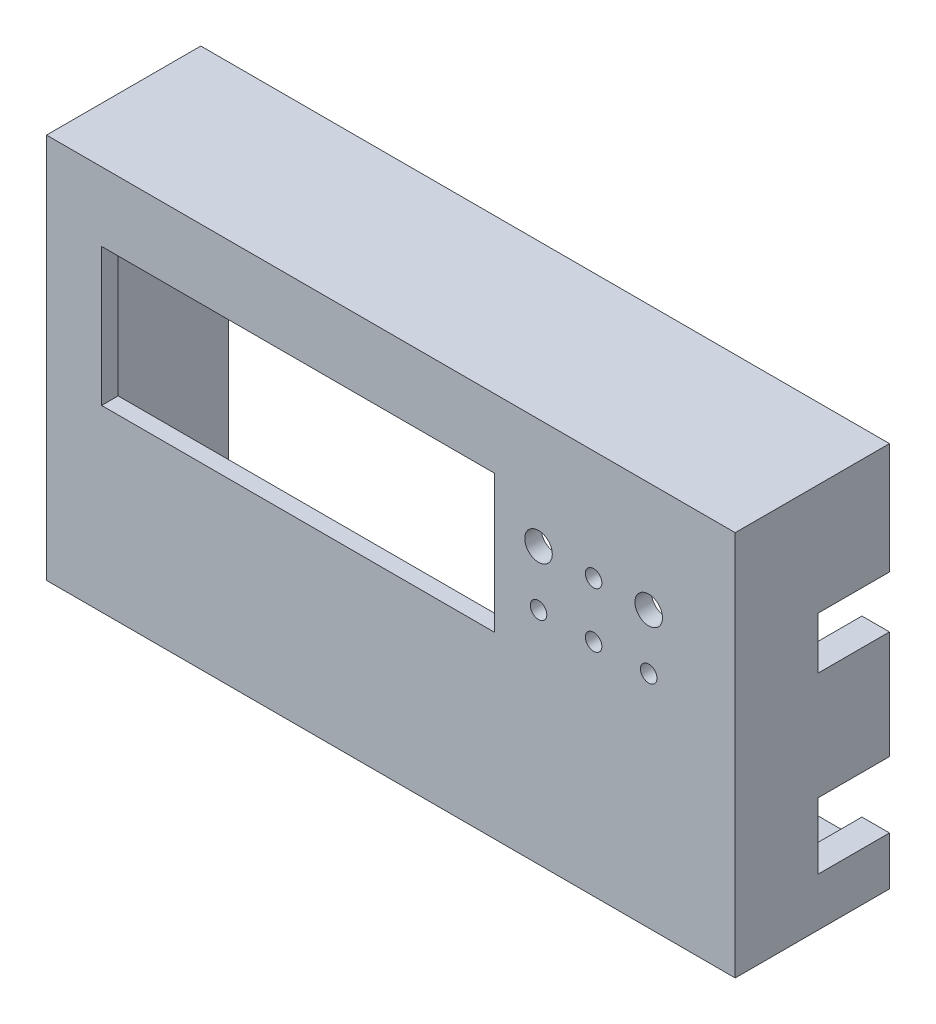
ISO-10303-21;
HEADER;
FILE_DESCRIPTION(('STEP AP214'),'2;1');
FILE_NAME('part.step','',(''),(''),'','','');
FILE_SCHEMA(('AUTOMOTIVE_DESIGN { 1 0 10303 214 1 1 1 1 }'));
ENDSEC;
DATA;
#1=APPLICATION_CONTEXT('core data for automotive mechanical design processes');
#2=APPLICATION_PROTOCOL_DEFINITION('international standard','automotive_design',2000,#1);
#3=PRODUCT_CONTEXT('',#1,'mechanical');
#4=PRODUCT('Part','Part','',(#3));
#5=PRODUCT_RELATED_PRODUCT_CATEGORY('part','',(#4));
#6=PRODUCT_DEFINITION_FORMATION('','',#4);
#7=PRODUCT_DEFINITION_CONTEXT('part definition',#1,'design');
#8=PRODUCT_DEFINITION('design','',#6,#7);
#9=PRODUCT_DEFINITION_SHAPE('','',#8);
#10=(LENGTH_UNIT() NAMED_UNIT(*) SI_UNIT(.MILLI.,.METRE.));
#11=(NAMED_UNIT(*) PLANE_ANGLE_UNIT() SI_UNIT($,.RADIAN.));
#12=(NAMED_UNIT(*) SI_UNIT($,.STERADIAN.) SOLID_ANGLE_UNIT());
#13=UNCERTAINTY_MEASURE_WITH_UNIT(LENGTH_MEASURE(1.E-05),#10,'distance_accuracy_value','');
#14=(GEOMETRIC_REPRESENTATION_CONTEXT(3) GLOBAL_UNCERTAINTY_ASSIGNED_CONTEXT((#13)) GLOBAL_UNIT_ASSIGNED_CONTEXT((#10,
#11,#12)) REPRESENTATION_CONTEXT('',''));
#15=CARTESIAN_POINT('',(0.,0.,0.));
#16=DIRECTION('',(0.,0.,1.));
#17=DIRECTION('',(1.,0.,0.));
#18=AXIS2_PLACEMENT_3D('',#15,#16,#17);
#19=CARTESIAN_POINT('',(0.,0.,-25.));
#20=DIRECTION('',(0.,0.,-1.));
#21=DIRECTION('',(-1.,0.,0.));
#22=AXIS2_PLACEMENT_3D('',#19,#20,#21);
#23=PLANE('',#22);
#24=DIRECTION('',(1.,0.,0.));
#25=VECTOR('',#24,1.);
#26=CARTESIAN_POINT('',(115.,8.8,-25.));
#27=LINE('',#26,#25);
#28=CARTESIAN_POINT('',(120.,8.8,-25.));
#29=VERTEX_POINT('',#28);
#30=CARTESIAN_POINT('',(125.,8.8,-25.));
#31=VERTEX_POINT('',#30);
#32=EDGE_CURVE('E379',#29,#31,#27,.T.);
#33=ORIENTED_EDGE('',*,*,#32,.T.);
#34=DIRECTION('',(0.,1.,0.));
#35=VECTOR('',#34,1.);
#36=CARTESIAN_POINT('',(125.,0.,-25.));
#37=LINE('',#36,#35);
#38=CARTESIAN_POINT('',(125.,0.,-25.));
#39=VERTEX_POINT('',#38);
#40=EDGE_CURVE('E227',#39,#31,#37,.T.);
#41=ORIENTED_EDGE('',*,*,#40,.F.);
#42=DIRECTION('',(1.,0.,0.));
#43=VECTOR('',#42,1.);
#44=CARTESIAN_POINT('',(0.,0.,-25.));
#45=LINE('',#44,#43);
#46=CARTESIAN_POINT('',(0.,0.,-25.));
#47=VERTEX_POINT('',#46);
#48=EDGE_CURVE('E232',#47,#39,#45,.T.);
#49=ORIENTED_EDGE('',*,*,#48,.F.);
#50=DIRECTION('',(0.,1.,0.));
#51=VECTOR('',#50,1.);
#52=CARTESIAN_POINT('',(0.,0.,-25.));
#53=LINE('',#52,#51);
#54=CARTESIAN_POINT('',(0.,70.,-25.));
#55=VERTEX_POINT('',#54);
#56=EDGE_CURVE('E484',#47,#55,#53,.T.);
#57=ORIENTED_EDGE('',*,*,#56,.T.);
#58=DIRECTION('',(1.,0.,0.));
#59=VECTOR('',#58,1.);
#60=CARTESIAN_POINT('',(0.,70.,-25.));
#61=LINE('',#60,#59);
#62=CARTESIAN_POINT('',(125.,70.,-25.));
#63=VERTEX_POINT('',#62);
#64=EDGE_CURVE('E233',#55,#63,#61,.T.);
#65=ORIENTED_EDGE('',*,*,#64,.T.);
#66=CARTESIAN_POINT('',(125.,49.8225738807836,-25.));
#67=VERTEX_POINT('',#66);
#68=EDGE_CURVE('E228',#67,#63,#37,.T.);
#69=ORIENTED_EDGE('',*,*,#68,.F.);
#70=DIRECTION('',(1.,0.,0.));
#71=VECTOR('',#70,1.);
#72=CARTESIAN_POINT('',(115.,49.8225738807836,-25.));
#73=LINE('',#72,#71);
#74=CARTESIAN_POINT('',(120.,49.8225738807836,-25.));
#75=VERTEX_POINT('',#74);
#76=EDGE_CURVE('E399',#75,#67,#73,.T.);
#77=ORIENTED_EDGE('',*,*,#76,.F.);
#78=DIRECTION('',(0.,1.,0.));
#79=VECTOR('',#78,1.);
#80=CARTESIAN_POINT('',(120.,4.99999999999999,-25.));
#81=LINE('',#80,#79);
#82=CARTESIAN_POINT('',(120.,65.,-25.));
#83=VERTEX_POINT('',#82);
#84=EDGE_CURVE('E449',#75,#83,#81,.T.);
#85=ORIENTED_EDGE('',*,*,#84,.T.);
#86=DIRECTION('',(1.,0.,0.));
#87=VECTOR('',#86,1.);
#88=CARTESIAN_POINT('',(5.,65.,-25.));
#89=LINE('',#88,#87);
#90=CARTESIAN_POINT('',(5.,65.,-25.));
#91=VERTEX_POINT('',#90);
#92=EDGE_CURVE('E444',#91,#83,#89,.T.);
#93=ORIENTED_EDGE('',*,*,#92,.F.);
#94=DIRECTION('',(0.,1.,0.));
#95=VECTOR('',#94,1.);
#96=CARTESIAN_POINT('',(5.,5.,-25.));
#97=LINE('',#96,#95);
#98=CARTESIAN_POINT('',(5.,5.,-25.));
#99=VERTEX_POINT('',#98);
#100=EDGE_CURVE('E441',#99,#91,#97,.T.);
#101=ORIENTED_EDGE('',*,*,#100,.F.);
#102=DIRECTION('',(1.,0.,0.));
#103=VECTOR('',#102,1.);
#104=CARTESIAN_POINT('',(5.,5.,-25.));
#105=LINE('',#104,#103);
#106=CARTESIAN_POINT('',(120.,4.99999999999999,-25.));
#107=VERTEX_POINT('',#106);
#108=EDGE_CURVE('E453',#99,#107,#105,.T.);
#109=ORIENTED_EDGE('',*,*,#108,.T.);
#110=EDGE_CURVE('E450',#107,#29,#81,.T.);
#111=ORIENTED_EDGE('',*,*,#110,.T.);
#112=EDGE_LOOP('',(#33,#41,#49,#57,#65,#69,#77,#85,#93,#101,#109,#111));
#113=FACE_BOUND('',#112,.T.);
#114=CARTESIAN_POINT('',(122.5,2.5,-25.));
#115=DIRECTION('',(0.,0.,-1.));
#116=DIRECTION('',(-1.,0.,0.));
#117=AXIS2_PLACEMENT_3D('',#114,#115,#116);
#118=CIRCLE('',#117,2.);
#119=CARTESIAN_POINT('',(120.5,2.5,-25.));
#120=VERTEX_POINT('',#119);
#121=EDGE_CURVE('E384',#120,#120,#118,.T.);
#122=ORIENTED_EDGE('',*,*,#121,.F.);
#123=EDGE_LOOP('',(#122));
#124=FACE_BOUND('',#123,.T.);
#125=CARTESIAN_POINT('',(2.5,2.5,-25.));
#126=DIRECTION('',(0.,0.,-1.));
#127=DIRECTION('',(-1.,0.,0.));
#128=AXIS2_PLACEMENT_3D('',#125,#126,#127);
#129=CIRCLE('',#128,2.);
#130=CARTESIAN_POINT('',(0.5,2.5,-25.));
#131=VERTEX_POINT('',#130);
#132=EDGE_CURVE('E422',#131,#131,#129,.T.);
#133=ORIENTED_EDGE('',*,*,#132,.F.);
#134=EDGE_LOOP('',(#133));
#135=FACE_BOUND('',#134,.T.);
#136=CARTESIAN_POINT('',(2.5,67.5,-25.));
#137=DIRECTION('',(0.,0.,-1.));
#138=DIRECTION('',(-1.,0.,0.));
#139=AXIS2_PLACEMENT_3D('',#136,#137,#138);
#140=CIRCLE('',#139,2.);
#141=CARTESIAN_POINT('',(0.5,67.5,-25.));
#142=VERTEX_POINT('',#141);
#143=EDGE_CURVE('E414',#142,#142,#140,.T.);
#144=ORIENTED_EDGE('',*,*,#143,.F.);
#145=EDGE_LOOP('',(#144));
#146=FACE_BOUND('',#145,.T.);
#147=CARTESIAN_POINT('',(122.5,67.5,-25.));
#148=DIRECTION('',(0.,0.,-1.));
#149=DIRECTION('',(-1.,0.,0.));
#150=AXIS2_PLACEMENT_3D('',#147,#148,#149);
#151=CIRCLE('',#150,2.);
#152=CARTESIAN_POINT('',(120.5,67.5,-25.));
#153=VERTEX_POINT('',#152);
#154=EDGE_CURVE('E413',#153,#153,#151,.T.);
#155=ORIENTED_EDGE('',*,*,#154,.F.);
#156=EDGE_LOOP('',(#155));
#157=FACE_BOUND('',#156,.T.);
#158=ADVANCED_FACE('F62',(#113,#124,#135,#146,#157),#23,.T.);
#159=CARTESIAN_POINT('',(0.,0.,3.));
#160=DIRECTION('',(1.,0.,0.));
#161=DIRECTION('',(0.,0.,-1.));
#162=AXIS2_PLACEMENT_3D('',#159,#160,#161);
#163=PLANE('',#162);
#164=DIRECTION('',(0.,0.,-1.));
#165=VECTOR('',#164,1.);
#166=CARTESIAN_POINT('',(0.,70.,3.));
#167=LINE('',#166,#165);
#168=CARTESIAN_POINT('',(0.,70.,3.));
#169=VERTEX_POINT('',#168);
#170=EDGE_CURVE('E307',#169,#55,#167,.T.);
#171=ORIENTED_EDGE('',*,*,#170,.T.);
#172=ORIENTED_EDGE('',*,*,#56,.F.);
#173=DIRECTION('',(0.,0.,-1.));
#174=VECTOR('',#173,1.);
#175=CARTESIAN_POINT('',(0.,0.,3.));
#176=LINE('',#175,#174);
#177=CARTESIAN_POINT('',(0.,0.,3.));
#178=VERTEX_POINT('',#177);
#179=EDGE_CURVE('E317',#178,#47,#176,.T.);
#180=ORIENTED_EDGE('',*,*,#179,.F.);
#181=DIRECTION('',(0.,-1.,0.));
#182=VECTOR('',#181,1.);
#183=CARTESIAN_POINT('',(0.,0.,3.));
#184=LINE('',#183,#182);
#185=EDGE_CURVE('E285',#169,#178,#184,.T.);
#186=ORIENTED_EDGE('',*,*,#185,.F.);
#187=EDGE_LOOP('',(#171,#172,#180,#186));
#188=FACE_BOUND('',#187,.T.);
#189=ADVANCED_FACE('F64',(#188),#163,.F.);
#190=CARTESIAN_POINT('',(0.,0.,3.));
#191=DIRECTION('',(0.,1.,0.));
#192=DIRECTION('',(0.,0.,1.));
#193=AXIS2_PLACEMENT_3D('',#190,#191,#192);
#194=PLANE('',#193);
#195=ORIENTED_EDGE('',*,*,#179,.T.);
#196=ORIENTED_EDGE('',*,*,#48,.T.);
#197=DIRECTION('',(0.,0.,-1.));
#198=VECTOR('',#197,1.);
#199=CARTESIAN_POINT('',(125.,0.,3.));
#200=LINE('',#199,#198);
#201=CARTESIAN_POINT('',(125.,0.,3.));
#202=VERTEX_POINT('',#201);
#203=EDGE_CURVE('E314',#202,#39,#200,.T.);
#204=ORIENTED_EDGE('',*,*,#203,.F.);
#205=DIRECTION('',(1.,0.,0.));
#206=VECTOR('',#205,1.);
#207=CARTESIAN_POINT('',(0.,0.,3.));
#208=LINE('',#207,#206);
#209=EDGE_CURVE('E298',#178,#202,#208,.T.);
#210=ORIENTED_EDGE('',*,*,#209,.F.);
#211=EDGE_LOOP('',(#195,#196,#204,#210));
#212=FACE_BOUND('',#211,.T.);
#213=ADVANCED_FACE('F533',(#212),#194,.F.);
#214=CARTESIAN_POINT('',(125.,0.,3.));
#215=DIRECTION('',(-1.,0.,0.));
#216=DIRECTION('',(0.,0.,1.));
#217=AXIS2_PLACEMENT_3D('',#214,#215,#216);
#218=PLANE('',#217);
#219=ORIENTED_EDGE('',*,*,#40,.T.);
#220=DIRECTION('',(0.,0.,-1.));
#221=VECTOR('',#220,1.);
#222=CARTESIAN_POINT('',(125.,8.8,-25.));
#223=LINE('',#222,#221);
#224=CARTESIAN_POINT('',(125.,8.8,-12.));
#225=VERTEX_POINT('',#224);
#226=EDGE_CURVE('E210',#225,#31,#223,.T.);
#227=ORIENTED_EDGE('',*,*,#226,.F.);
#228=DIRECTION('',(0.,-1.,0.));
#229=VECTOR('',#228,1.);
#230=CARTESIAN_POINT('',(125.,8.8,-12.));
#231=LINE('',#230,#229);
#232=CARTESIAN_POINT('',(125.,20.8,-12.));
#233=VERTEX_POINT('',#232);
#234=EDGE_CURVE('E220',#233,#225,#231,.T.);
#235=ORIENTED_EDGE('',*,*,#234,.F.);
#236=DIRECTION('',(0.,0.,1.));
#237=VECTOR('',#236,1.);
#238=CARTESIAN_POINT('',(125.,20.8,-25.));
#239=LINE('',#238,#237);
#240=CARTESIAN_POINT('',(125.,20.8,-25.));
#241=VERTEX_POINT('',#240);
#242=EDGE_CURVE('E201',#241,#233,#239,.T.);
#243=ORIENTED_EDGE('',*,*,#242,.F.);
#244=CARTESIAN_POINT('',(125.,40.4,-25.));
#245=VERTEX_POINT('',#244);
#246=EDGE_CURVE('E217',#241,#245,#37,.T.);
#247=ORIENTED_EDGE('',*,*,#246,.T.);
#248=DIRECTION('',(0.,0.,-1.));
#249=VECTOR('',#248,1.);
#250=CARTESIAN_POINT('',(125.,40.4,-25.));
#251=LINE('',#250,#249);
#252=CARTESIAN_POINT('',(125.,40.4,-12.));
#253=VERTEX_POINT('',#252);
#254=EDGE_CURVE('E396',#253,#245,#251,.T.);
#255=ORIENTED_EDGE('',*,*,#254,.F.);
#256=DIRECTION('',(0.,-1.,0.));
#257=VECTOR('',#256,1.);
#258=CARTESIAN_POINT('',(125.,40.4,-12.));
#259=LINE('',#258,#257);
#260=CARTESIAN_POINT('',(125.,49.8225738807836,-12.));
#261=VERTEX_POINT('',#260);
#262=EDGE_CURVE('E392',#261,#253,#259,.T.);
#263=ORIENTED_EDGE('',*,*,#262,.F.);
#264=DIRECTION('',(0.,0.,1.));
#265=VECTOR('',#264,1.);
#266=CARTESIAN_POINT('',(125.,49.8225738807836,-25.));
#267=LINE('',#266,#265);
#268=EDGE_CURVE('E389',#67,#261,#267,.T.);
#269=ORIENTED_EDGE('',*,*,#268,.F.);
#270=ORIENTED_EDGE('',*,*,#68,.T.);
#271=DIRECTION('',(0.,0.,-1.));
#272=VECTOR('',#271,1.);
#273=CARTESIAN_POINT('',(125.,70.,3.));
#274=LINE('',#273,#272);
#275=CARTESIAN_POINT('',(125.,70.,3.));
#276=VERTEX_POINT('',#275);
#277=EDGE_CURVE('E310',#276,#63,#274,.T.);
#278=ORIENTED_EDGE('',*,*,#277,.F.);
#279=DIRECTION('',(0.,1.,0.));
#280=VECTOR('',#279,1.);
#281=CARTESIAN_POINT('',(125.,0.,3.));
#282=LINE('',#281,#280);
#283=EDGE_CURVE('E301',#202,#276,#282,.T.);
#284=ORIENTED_EDGE('',*,*,#283,.F.);
#285=ORIENTED_EDGE('',*,*,#203,.T.);
#286=EDGE_LOOP('',(#219,#227,#235,#243,#247,#255,#263,#269,#270,#278,#284,#285));
#287=FACE_BOUND('',#286,.T.);
#288=ADVANCED_FACE('F215',(#287),#218,.F.);
#289=CARTESIAN_POINT('',(0.,70.,3.));
#290=DIRECTION('',(0.,-1.,0.));
#291=DIRECTION('',(0.,0.,-1.));
#292=AXIS2_PLACEMENT_3D('',#289,#290,#291);
#293=PLANE('',#292);
#294=ORIENTED_EDGE('',*,*,#277,.T.);
#295=ORIENTED_EDGE('',*,*,#64,.F.);
#296=ORIENTED_EDGE('',*,*,#170,.F.);
#297=DIRECTION('',(-1.,0.,0.));
#298=VECTOR('',#297,1.);
#299=CARTESIAN_POINT('',(0.,70.,3.));
#300=LINE('',#299,#298);
#301=EDGE_CURVE('E304',#276,#169,#300,.T.);
#302=ORIENTED_EDGE('',*,*,#301,.F.);
#303=EDGE_LOOP('',(#294,#295,#296,#302));
#304=FACE_BOUND('',#303,.T.);
#305=ADVANCED_FACE('F498',(#304),#293,.F.);
#306=CARTESIAN_POINT('',(0.,0.,3.));
#307=DIRECTION('',(0.,0.,-1.));
#308=DIRECTION('',(-1.,0.,0.));
#309=AXIS2_PLACEMENT_3D('',#306,#307,#308);
#310=PLANE('',#309);
#311=CARTESIAN_POINT('',(99.3,50.,3.));
#312=DIRECTION('',(0.,0.,1.));
#313=DIRECTION('',(1.,0.,0.));
#314=AXIS2_PLACEMENT_3D('',#311,#312,#313);
#315=CIRCLE('',#314,1.5);
#316=CARTESIAN_POINT('',(100.8,50.,3.));
#317=VERTEX_POINT('',#316);
#318=EDGE_CURVE('E245',#317,#317,#315,.T.);
#319=ORIENTED_EDGE('',*,*,#318,.F.);
#320=EDGE_LOOP('',(#319));
#321=FACE_BOUND('',#320,.T.);
#322=CARTESIAN_POINT('',(109.3,50.,3.));
#323=DIRECTION('',(0.,0.,1.));
#324=DIRECTION('',(1.,0.,0.));
#325=AXIS2_PLACEMENT_3D('',#322,#323,#324);
#326=CIRCLE('',#325,2.5);
#327=CARTESIAN_POINT('',(111.8,50.,3.));
#328=VERTEX_POINT('',#327);
#329=EDGE_CURVE('E250',#328,#328,#326,.T.);
#330=ORIENTED_EDGE('',*,*,#329,.F.);
#331=EDGE_LOOP('',(#330));
#332=FACE_BOUND('',#331,.T.);
#333=CARTESIAN_POINT('',(89.3,40.,3.));
#334=DIRECTION('',(0.,0.,1.));
#335=DIRECTION('',(1.,0.,0.));
#336=AXIS2_PLACEMENT_3D('',#333,#334,#335);
#337=CIRCLE('',#336,1.5);
#338=CARTESIAN_POINT('',(90.8,40.,3.));
#339=VERTEX_POINT('',#338);
#340=EDGE_CURVE('E254',#339,#339,#337,.T.);
#341=ORIENTED_EDGE('',*,*,#340,.F.);
#342=EDGE_LOOP('',(#341));
#343=FACE_BOUND('',#342,.T.);
#344=CARTESIAN_POINT('',(99.3,40.,3.));
#345=DIRECTION('',(0.,0.,1.));
#346=DIRECTION('',(1.,0.,0.));
#347=AXIS2_PLACEMENT_3D('',#344,#345,#346);
#348=CIRCLE('',#347,1.5);
#349=CARTESIAN_POINT('',(100.8,40.,3.));
#350=VERTEX_POINT('',#349);
#351=EDGE_CURVE('E244',#350,#350,#348,.T.);
#352=ORIENTED_EDGE('',*,*,#351,.F.);
#353=EDGE_LOOP('',(#352));
#354=FACE_BOUND('',#353,.T.);
#355=CARTESIAN_POINT('',(109.3,40.,3.));
#356=DIRECTION('',(0.,0.,1.));
#357=DIRECTION('',(1.,0.,0.));
#358=AXIS2_PLACEMENT_3D('',#355,#356,#357);
#359=CIRCLE('',#358,1.5);
#360=CARTESIAN_POINT('',(110.8,40.,3.));
#361=VERTEX_POINT('',#360);
#362=EDGE_CURVE('E240',#361,#361,#359,.T.);
#363=ORIENTED_EDGE('',*,*,#362,.F.);
#364=EDGE_LOOP('',(#363));
#365=FACE_BOUND('',#364,.T.);
#366=CARTESIAN_POINT('',(89.3,50.,3.));
#367=DIRECTION('',(0.,0.,1.));
#368=DIRECTION('',(1.,0.,0.));
#369=AXIS2_PLACEMENT_3D('',#366,#367,#368);
#370=CIRCLE('',#369,2.5);
#371=CARTESIAN_POINT('',(91.8,50.,3.));
#372=VERTEX_POINT('',#371);
#373=EDGE_CURVE('E249',#372,#372,#370,.T.);
#374=ORIENTED_EDGE('',*,*,#373,.F.);
#375=EDGE_LOOP('',(#374));
#376=FACE_BOUND('',#375,.T.);
#377=DIRECTION('',(1.,0.,0.));
#378=VECTOR('',#377,1.);
#379=CARTESIAN_POINT('',(10.,32.5,3.));
#380=LINE('',#379,#378);
#381=CARTESIAN_POINT('',(10.,32.5,3.));
#382=VERTEX_POINT('',#381);
#383=CARTESIAN_POINT('',(81.3,32.5,3.));
#384=VERTEX_POINT('',#383);
#385=EDGE_CURVE('E268',#382,#384,#380,.T.);
#386=ORIENTED_EDGE('',*,*,#385,.F.);
#387=DIRECTION('',(0.,-1.,0.));
#388=VECTOR('',#387,1.);
#389=CARTESIAN_POINT('',(10.,57.5,3.));
#390=LINE('',#389,#388);
#391=CARTESIAN_POINT('',(10.,57.5,3.));
#392=VERTEX_POINT('',#391);
#393=EDGE_CURVE('E265',#392,#382,#390,.T.);
#394=ORIENTED_EDGE('',*,*,#393,.F.);
#395=DIRECTION('',(-1.,0.,0.));
#396=VECTOR('',#395,1.);
#397=CARTESIAN_POINT('',(10.,57.5,3.));
#398=LINE('',#397,#396);
#399=CARTESIAN_POINT('',(81.3,57.5,3.));
#400=VERTEX_POINT('',#399);
#401=EDGE_CURVE('E277',#400,#392,#398,.T.);
#402=ORIENTED_EDGE('',*,*,#401,.F.);
#403=DIRECTION('',(0.,1.,0.));
#404=VECTOR('',#403,1.);
#405=CARTESIAN_POINT('',(81.3,57.5,3.));
#406=LINE('',#405,#404);
#407=EDGE_CURVE('E273',#384,#400,#406,.T.);
#408=ORIENTED_EDGE('',*,*,#407,.F.);
#409=EDGE_LOOP('',(#386,#394,#402,#408));
#410=FACE_BOUND('',#409,.T.);
#411=ORIENTED_EDGE('',*,*,#185,.T.);
#412=ORIENTED_EDGE('',*,*,#209,.T.);
#413=ORIENTED_EDGE('',*,*,#283,.T.);
#414=ORIENTED_EDGE('',*,*,#301,.T.);
#415=EDGE_LOOP('',(#411,#412,#413,#414));
#416=FACE_BOUND('',#415,.T.);
#417=ADVANCED_FACE('F587',(#321,#332,#343,#354,#365,#376,#410,#416),#310,.F.);
#418=CARTESIAN_POINT('',(0.,0.,0.));
#419=DIRECTION('',(0.,0.,-1.));
#420=DIRECTION('',(-1.,0.,0.));
#421=AXIS2_PLACEMENT_3D('',#418,#419,#420);
#422=PLANE('',#421);
#423=DIRECTION('',(0.,1.,0.));
#424=VECTOR('',#423,1.);
#425=CARTESIAN_POINT('',(5.,5.,0.));
#426=LINE('',#425,#424);
#427=CARTESIAN_POINT('',(5.,5.,0.));
#428=VERTEX_POINT('',#427);
#429=CARTESIAN_POINT('',(5.,65.,0.));
#430=VERTEX_POINT('',#429);
#431=EDGE_CURVE('E437',#428,#430,#426,.T.);
#432=ORIENTED_EDGE('',*,*,#431,.T.);
#433=DIRECTION('',(1.,0.,0.));
#434=VECTOR('',#433,1.);
#435=CARTESIAN_POINT('',(5.,65.,0.));
#436=LINE('',#435,#434);
#437=CARTESIAN_POINT('',(120.,65.,0.));
#438=VERTEX_POINT('',#437);
#439=EDGE_CURVE('E462',#430,#438,#436,.T.);
#440=ORIENTED_EDGE('',*,*,#439,.T.);
#441=DIRECTION('',(0.,1.,0.));
#442=VECTOR('',#441,1.);
#443=CARTESIAN_POINT('',(120.,4.99999999999999,0.));
#444=LINE('',#443,#442);
#445=CARTESIAN_POINT('',(120.,4.99999999999999,0.));
#446=VERTEX_POINT('',#445);
#447=EDGE_CURVE('E466',#446,#438,#444,.T.);
#448=ORIENTED_EDGE('',*,*,#447,.F.);
#449=DIRECTION('',(1.,0.,0.));
#450=VECTOR('',#449,1.);
#451=CARTESIAN_POINT('',(5.,5.,0.));
#452=LINE('',#451,#450);
#453=EDGE_CURVE('E445',#428,#446,#452,.T.);
#454=ORIENTED_EDGE('',*,*,#453,.F.);
#455=EDGE_LOOP('',(#432,#440,#448,#454));
#456=FACE_BOUND('',#455,.T.);
#457=CARTESIAN_POINT('',(99.3,50.,0.));
#458=DIRECTION('',(0.,0.,-1.));
#459=DIRECTION('',(-1.,0.,0.));
#460=AXIS2_PLACEMENT_3D('',#457,#458,#459);
#461=CIRCLE('',#460,1.5);
#462=CARTESIAN_POINT('',(97.8,50.,0.));
#463=VERTEX_POINT('',#462);
#464=EDGE_CURVE('E269',#463,#463,#461,.T.);
#465=ORIENTED_EDGE('',*,*,#464,.F.);
#466=EDGE_LOOP('',(#465));
#467=FACE_BOUND('',#466,.T.);
#468=CARTESIAN_POINT('',(109.3,50.,0.));
#469=DIRECTION('',(0.,0.,-1.));
#470=DIRECTION('',(-1.,0.,0.));
#471=AXIS2_PLACEMENT_3D('',#468,#469,#470);
#472=CIRCLE('',#471,2.5);
#473=CARTESIAN_POINT('',(106.8,50.,0.));
#474=VERTEX_POINT('',#473);
#475=EDGE_CURVE('E349',#474,#474,#472,.T.);
#476=ORIENTED_EDGE('',*,*,#475,.F.);
#477=EDGE_LOOP('',(#476));
#478=FACE_BOUND('',#477,.T.);
#479=CARTESIAN_POINT('',(89.3,40.,0.));
#480=DIRECTION('',(0.,0.,-1.));
#481=DIRECTION('',(-1.,0.,0.));
#482=AXIS2_PLACEMENT_3D('',#479,#480,#481);
#483=CIRCLE('',#482,1.5);
#484=CARTESIAN_POINT('',(87.8,40.,0.));
#485=VERTEX_POINT('',#484);
#486=EDGE_CURVE('E345',#485,#485,#483,.T.);
#487=ORIENTED_EDGE('',*,*,#486,.F.);
#488=EDGE_LOOP('',(#487));
#489=FACE_BOUND('',#488,.T.);
#490=CARTESIAN_POINT('',(99.3,40.,0.));
#491=DIRECTION('',(0.,0.,-1.));
#492=DIRECTION('',(-1.,0.,0.));
#493=AXIS2_PLACEMENT_3D('',#490,#491,#492);
#494=CIRCLE('',#493,1.5);
#495=CARTESIAN_POINT('',(97.8,40.,0.));
#496=VERTEX_POINT('',#495);
#497=EDGE_CURVE('E341',#496,#496,#494,.T.);
#498=ORIENTED_EDGE('',*,*,#497,.F.);
#499=EDGE_LOOP('',(#498));
#500=FACE_BOUND('',#499,.T.);
#501=CARTESIAN_POINT('',(109.3,40.,0.));
#502=DIRECTION('',(0.,0.,-1.));
#503=DIRECTION('',(-1.,0.,0.));
#504=AXIS2_PLACEMENT_3D('',#501,#502,#503);
#505=CIRCLE('',#504,1.5);
#506=CARTESIAN_POINT('',(107.8,40.,0.));
#507=VERTEX_POINT('',#506);
#508=EDGE_CURVE('E337',#507,#507,#505,.T.);
#509=ORIENTED_EDGE('',*,*,#508,.F.);
#510=EDGE_LOOP('',(#509));
#511=FACE_BOUND('',#510,.T.);
#512=CARTESIAN_POINT('',(89.3,50.,0.));
#513=DIRECTION('',(0.,0.,-1.));
#514=DIRECTION('',(-1.,0.,0.));
#515=AXIS2_PLACEMENT_3D('',#512,#513,#514);
#516=CIRCLE('',#515,2.5);
#517=CARTESIAN_POINT('',(86.8,50.,0.));
#518=VERTEX_POINT('',#517);
#519=EDGE_CURVE('E264',#518,#518,#516,.T.);
#520=ORIENTED_EDGE('',*,*,#519,.F.);
#521=EDGE_LOOP('',(#520));
#522=FACE_BOUND('',#521,.T.);
#523=DIRECTION('',(0.,1.,0.));
#524=VECTOR('',#523,1.);
#525=CARTESIAN_POINT('',(10.,0.,0.));
#526=LINE('',#525,#524);
#527=CARTESIAN_POINT('',(10.,32.5,0.));
#528=VERTEX_POINT('',#527);
#529=CARTESIAN_POINT('',(10.,57.5,0.));
#530=VERTEX_POINT('',#529);
#531=EDGE_CURVE('E330',#528,#530,#526,.T.);
#532=ORIENTED_EDGE('',*,*,#531,.F.);
#533=DIRECTION('',(-1.,0.,0.));
#534=VECTOR('',#533,1.);
#535=CARTESIAN_POINT('',(0.,32.5,0.));
#536=LINE('',#535,#534);
#537=CARTESIAN_POINT('',(81.3,32.5,0.));
#538=VERTEX_POINT('',#537);
#539=EDGE_CURVE('E320',#538,#528,#536,.T.);
#540=ORIENTED_EDGE('',*,*,#539,.F.);
#541=DIRECTION('',(0.,-1.,0.));
#542=VECTOR('',#541,1.);
#543=CARTESIAN_POINT('',(81.3,0.,0.));
#544=LINE('',#543,#542);
#545=CARTESIAN_POINT('',(81.3,57.5,0.));
#546=VERTEX_POINT('',#545);
#547=EDGE_CURVE('E323',#546,#538,#544,.T.);
#548=ORIENTED_EDGE('',*,*,#547,.F.);
#549=DIRECTION('',(1.,0.,0.));
#550=VECTOR('',#549,1.);
#551=CARTESIAN_POINT('',(0.,57.5,0.));
#552=LINE('',#551,#550);
#553=EDGE_CURVE('E327',#530,#546,#552,.T.);
#554=ORIENTED_EDGE('',*,*,#553,.F.);
#555=EDGE_LOOP('',(#532,#540,#548,#554));
#556=FACE_BOUND('',#555,.T.);
#557=ADVANCED_FACE('F585',(#456,#467,#478,#489,#500,#511,#522,#556),#422,.T.);
#558=CARTESIAN_POINT('',(10.,57.5,-2.));
#559=DIRECTION('',(-1.,0.,0.));
#560=DIRECTION('',(0.,-1.,0.));
#561=AXIS2_PLACEMENT_3D('',#558,#559,#560);
#562=PLANE('',#561);
#563=ORIENTED_EDGE('',*,*,#531,.T.);
#564=DIRECTION('',(0.,0.,1.));
#565=VECTOR('',#564,1.);
#566=CARTESIAN_POINT('',(10.,57.5,-2.));
#567=LINE('',#566,#565);
#568=EDGE_CURVE('E282',#530,#392,#567,.T.);
#569=ORIENTED_EDGE('',*,*,#568,.T.);
#570=ORIENTED_EDGE('',*,*,#393,.T.);
#571=DIRECTION('',(0.,0.,1.));
#572=VECTOR('',#571,1.);
#573=CARTESIAN_POINT('',(10.,32.5,-2.));
#574=LINE('',#573,#572);
#575=EDGE_CURVE('E281',#528,#382,#574,.T.);
#576=ORIENTED_EDGE('',*,*,#575,.F.);
#577=EDGE_LOOP('',(#563,#569,#570,#576));
#578=FACE_BOUND('',#577,.T.);
#579=ADVANCED_FACE('F575',(#578),#562,.F.);
#580=CARTESIAN_POINT('',(10.,57.5,-2.));
#581=DIRECTION('',(0.,1.,0.));
#582=DIRECTION('',(0.,0.,1.));
#583=AXIS2_PLACEMENT_3D('',#580,#581,#582);
#584=PLANE('',#583);
#585=ORIENTED_EDGE('',*,*,#553,.T.);
#586=DIRECTION('',(0.,0.,1.));
#587=VECTOR('',#586,1.);
#588=CARTESIAN_POINT('',(81.3,57.5,-2.));
#589=LINE('',#588,#587);
#590=EDGE_CURVE('E286',#546,#400,#589,.T.);
#591=ORIENTED_EDGE('',*,*,#590,.T.);
#592=ORIENTED_EDGE('',*,*,#401,.T.);
#593=ORIENTED_EDGE('',*,*,#568,.F.);
#594=EDGE_LOOP('',(#585,#591,#592,#593));
#595=FACE_BOUND('',#594,.T.);
#596=ADVANCED_FACE('F571',(#595),#584,.F.);
#597=CARTESIAN_POINT('',(81.3,57.5,-2.));
#598=DIRECTION('',(1.,0.,0.));
#599=DIRECTION('',(0.,1.,0.));
#600=AXIS2_PLACEMENT_3D('',#597,#598,#599);
#601=PLANE('',#600);
#602=ORIENTED_EDGE('',*,*,#547,.T.);
#603=DIRECTION('',(0.,0.,1.));
#604=VECTOR('',#603,1.);
#605=CARTESIAN_POINT('',(81.3,32.5,-2.));
#606=LINE('',#605,#604);
#607=EDGE_CURVE('E289',#538,#384,#606,.T.);
#608=ORIENTED_EDGE('',*,*,#607,.T.);
#609=ORIENTED_EDGE('',*,*,#407,.T.);
#610=ORIENTED_EDGE('',*,*,#590,.F.);
#611=EDGE_LOOP('',(#602,#608,#609,#610));
#612=FACE_BOUND('',#611,.T.);
#613=ADVANCED_FACE('F574',(#612),#601,.F.);
#614=CARTESIAN_POINT('',(10.,32.5,-2.));
#615=DIRECTION('',(0.,-1.,0.));
#616=DIRECTION('',(0.,0.,-1.));
#617=AXIS2_PLACEMENT_3D('',#614,#615,#616);
#618=PLANE('',#617);
#619=ORIENTED_EDGE('',*,*,#539,.T.);
#620=ORIENTED_EDGE('',*,*,#575,.T.);
#621=ORIENTED_EDGE('',*,*,#385,.T.);
#622=ORIENTED_EDGE('',*,*,#607,.F.);
#623=EDGE_LOOP('',(#619,#620,#621,#622));
#624=FACE_BOUND('',#623,.T.);
#625=ADVANCED_FACE('F569',(#624),#618,.F.);
#626=CARTESIAN_POINT('',(89.3,50.,-2.));
#627=DIRECTION('',(0.,0.,1.));
#628=DIRECTION('',(1.,0.,0.));
#629=AXIS2_PLACEMENT_3D('',#626,#627,#628);
#630=CYLINDRICAL_SURFACE('',#629,2.5);
#631=ORIENTED_EDGE('',*,*,#519,.T.);
#632=EDGE_LOOP('',(#631));
#633=FACE_BOUND('',#632,.T.);
#634=ORIENTED_EDGE('',*,*,#373,.T.);
#635=EDGE_LOOP('',(#634));
#636=FACE_BOUND('',#635,.T.);
#637=ADVANCED_FACE('F566',(#633,#636),#630,.F.);
#638=CARTESIAN_POINT('',(109.3,40.,-2.));
#639=DIRECTION('',(0.,0.,1.));
#640=DIRECTION('',(1.,0.,0.));
#641=AXIS2_PLACEMENT_3D('',#638,#639,#640);
#642=CYLINDRICAL_SURFACE('',#641,1.5);
#643=ORIENTED_EDGE('',*,*,#508,.T.);
#644=EDGE_LOOP('',(#643));
#645=FACE_BOUND('',#644,.T.);
#646=ORIENTED_EDGE('',*,*,#362,.T.);
#647=EDGE_LOOP('',(#646));
#648=FACE_BOUND('',#647,.T.);
#649=ADVANCED_FACE('F557',(#645,#648),#642,.F.);
#650=CARTESIAN_POINT('',(99.3,40.,-2.));
#651=DIRECTION('',(0.,0.,1.));
#652=DIRECTION('',(1.,0.,0.));
#653=AXIS2_PLACEMENT_3D('',#650,#651,#652);
#654=CYLINDRICAL_SURFACE('',#653,1.5);
#655=ORIENTED_EDGE('',*,*,#497,.T.);
#656=EDGE_LOOP('',(#655));
#657=FACE_BOUND('',#656,.T.);
#658=ORIENTED_EDGE('',*,*,#351,.T.);
#659=EDGE_LOOP('',(#658));
#660=FACE_BOUND('',#659,.T.);
#661=ADVANCED_FACE('F561',(#657,#660),#654,.F.);
#662=CARTESIAN_POINT('',(89.3,40.,-2.));
#663=DIRECTION('',(0.,0.,1.));
#664=DIRECTION('',(1.,0.,0.));
#665=AXIS2_PLACEMENT_3D('',#662,#663,#664);
#666=CYLINDRICAL_SURFACE('',#665,1.5);
#667=ORIENTED_EDGE('',*,*,#486,.T.);
#668=EDGE_LOOP('',(#667));
#669=FACE_BOUND('',#668,.T.);
#670=ORIENTED_EDGE('',*,*,#340,.T.);
#671=EDGE_LOOP('',(#670));
#672=FACE_BOUND('',#671,.T.);
#673=ADVANCED_FACE('F553',(#669,#672),#666,.F.);
#674=CARTESIAN_POINT('',(109.3,50.,-2.));
#675=DIRECTION('',(0.,0.,1.));
#676=DIRECTION('',(1.,0.,0.));
#677=AXIS2_PLACEMENT_3D('',#674,#675,#676);
#678=CYLINDRICAL_SURFACE('',#677,2.5);
#679=ORIENTED_EDGE('',*,*,#475,.T.);
#680=EDGE_LOOP('',(#679));
#681=FACE_BOUND('',#680,.T.);
#682=ORIENTED_EDGE('',*,*,#329,.T.);
#683=EDGE_LOOP('',(#682));
#684=FACE_BOUND('',#683,.T.);
#685=ADVANCED_FACE('F547',(#681,#684),#678,.F.);
#686=CARTESIAN_POINT('',(99.3,50.,-2.));
#687=DIRECTION('',(0.,0.,1.));
#688=DIRECTION('',(1.,0.,0.));
#689=AXIS2_PLACEMENT_3D('',#686,#687,#688);
#690=CYLINDRICAL_SURFACE('',#689,1.5);
#691=ORIENTED_EDGE('',*,*,#464,.T.);
#692=EDGE_LOOP('',(#691));
#693=FACE_BOUND('',#692,.T.);
#694=ORIENTED_EDGE('',*,*,#318,.T.);
#695=EDGE_LOOP('',(#694));
#696=FACE_BOUND('',#695,.T.);
#697=ADVANCED_FACE('F539',(#693,#696),#690,.F.);
#698=DIRECTION('',(1.,0.,0.));
#699=VECTOR('',#698,1.);
#700=CARTESIAN_POINT('',(115.,20.8,-25.));
#701=LINE('',#700,#699);
#702=CARTESIAN_POINT('',(120.,20.8,-25.));
#703=VERTEX_POINT('',#702);
#704=EDGE_CURVE('E198',#703,#241,#701,.T.);
#705=ORIENTED_EDGE('',*,*,#704,.F.);
#706=CARTESIAN_POINT('',(120.,40.4,-25.));
#707=VERTEX_POINT('',#706);
#708=EDGE_CURVE('E454',#703,#707,#81,.T.);
#709=ORIENTED_EDGE('',*,*,#708,.T.);
#710=DIRECTION('',(1.,0.,0.));
#711=VECTOR('',#710,1.);
#712=CARTESIAN_POINT('',(115.,40.4,-25.));
#713=LINE('',#712,#711);
#714=EDGE_CURVE('E222',#707,#245,#713,.T.);
#715=ORIENTED_EDGE('',*,*,#714,.T.);
#716=ORIENTED_EDGE('',*,*,#246,.F.);
#717=EDGE_LOOP('',(#705,#709,#715,#716));
#718=FACE_BOUND('',#717,.T.);
#719=ADVANCED_FACE('F225',(#718),#23,.T.);
#720=CARTESIAN_POINT('',(5.,5.,-25.));
#721=DIRECTION('',(1.,0.,0.));
#722=DIRECTION('',(0.,0.,-1.));
#723=AXIS2_PLACEMENT_3D('',#720,#721,#722);
#724=PLANE('',#723);
#725=ORIENTED_EDGE('',*,*,#431,.F.);
#726=DIRECTION('',(0.,0.,1.));
#727=VECTOR('',#726,1.);
#728=CARTESIAN_POINT('',(5.,5.,-25.));
#729=LINE('',#728,#727);
#730=EDGE_CURVE('E458',#99,#428,#729,.T.);
#731=ORIENTED_EDGE('',*,*,#730,.F.);
#732=ORIENTED_EDGE('',*,*,#100,.T.);
#733=DIRECTION('',(0.,0.,1.));
#734=VECTOR('',#733,1.);
#735=CARTESIAN_POINT('',(5.,65.,-25.));
#736=LINE('',#735,#734);
#737=EDGE_CURVE('E481',#91,#430,#736,.T.);
#738=ORIENTED_EDGE('',*,*,#737,.T.);
#739=EDGE_LOOP('',(#725,#731,#732,#738));
#740=FACE_BOUND('',#739,.T.);
#741=ADVANCED_FACE('F538',(#740),#724,.T.);
#742=CARTESIAN_POINT('',(5.,65.,-25.));
#743=DIRECTION('',(0.,-1.,0.));
#744=DIRECTION('',(0.,0.,-1.));
#745=AXIS2_PLACEMENT_3D('',#742,#743,#744);
#746=PLANE('',#745);
#747=ORIENTED_EDGE('',*,*,#439,.F.);
#748=ORIENTED_EDGE('',*,*,#737,.F.);
#749=ORIENTED_EDGE('',*,*,#92,.T.);
#750=DIRECTION('',(0.,0.,1.));
#751=VECTOR('',#750,1.);
#752=CARTESIAN_POINT('',(120.,65.,-25.));
#753=LINE('',#752,#751);
#754=EDGE_CURVE('E478',#83,#438,#753,.T.);
#755=ORIENTED_EDGE('',*,*,#754,.T.);
#756=EDGE_LOOP('',(#747,#748,#749,#755));
#757=FACE_BOUND('',#756,.T.);
#758=ADVANCED_FACE('F544',(#757),#746,.T.);
#759=CARTESIAN_POINT('',(120.,4.99999999999999,-25.));
#760=DIRECTION('',(1.,0.,0.));
#761=DIRECTION('',(0.,0.,-1.));
#762=AXIS2_PLACEMENT_3D('',#759,#760,#761);
#763=PLANE('',#762);
#764=DIRECTION('',(0.,-1.,0.));
#765=VECTOR('',#764,1.);
#766=CARTESIAN_POINT('',(120.,4.99999999999999,-12.));
#767=LINE('',#766,#765);
#768=CARTESIAN_POINT('',(120.,20.8,-12.));
#769=VERTEX_POINT('',#768);
#770=CARTESIAN_POINT('',(120.,8.8,-12.));
#771=VERTEX_POINT('',#770);
#772=EDGE_CURVE('E71',#769,#771,#767,.T.);
#773=ORIENTED_EDGE('',*,*,#772,.T.);
#774=DIRECTION('',(0.,0.,-1.));
#775=VECTOR('',#774,1.);
#776=CARTESIAN_POINT('',(120.,8.8,-25.));
#777=LINE('',#776,#775);
#778=EDGE_CURVE('E12',#771,#29,#777,.T.);
#779=ORIENTED_EDGE('',*,*,#778,.T.);
#780=ORIENTED_EDGE('',*,*,#110,.F.);
#781=DIRECTION('',(0.,0.,1.));
#782=VECTOR('',#781,1.);
#783=CARTESIAN_POINT('',(120.,4.99999999999999,-25.));
#784=LINE('',#783,#782);
#785=EDGE_CURVE('E475',#107,#446,#784,.T.);
#786=ORIENTED_EDGE('',*,*,#785,.T.);
#787=ORIENTED_EDGE('',*,*,#447,.T.);
#788=ORIENTED_EDGE('',*,*,#754,.F.);
#789=ORIENTED_EDGE('',*,*,#84,.F.);
#790=DIRECTION('',(0.,0.,1.));
#791=VECTOR('',#790,1.);
#792=CARTESIAN_POINT('',(120.,49.8225738807836,-25.));
#793=LINE('',#792,#791);
#794=CARTESIAN_POINT('',(120.,49.8225738807836,-12.));
#795=VERTEX_POINT('',#794);
#796=EDGE_CURVE('E333',#75,#795,#793,.T.);
#797=ORIENTED_EDGE('',*,*,#796,.T.);
#798=DIRECTION('',(0.,-1.,0.));
#799=VECTOR('',#798,1.);
#800=CARTESIAN_POINT('',(120.,4.99999999999999,-12.));
#801=LINE('',#800,#799);
#802=CARTESIAN_POINT('',(120.,40.4,-12.));
#803=VERTEX_POINT('',#802);
#804=EDGE_CURVE('E359',#795,#803,#801,.T.);
#805=ORIENTED_EDGE('',*,*,#804,.T.);
#806=DIRECTION('',(0.,0.,-1.));
#807=VECTOR('',#806,1.);
#808=CARTESIAN_POINT('',(120.,40.4,-25.));
#809=LINE('',#808,#807);
#810=EDGE_CURVE('E363',#803,#707,#809,.T.);
#811=ORIENTED_EDGE('',*,*,#810,.T.);
#812=ORIENTED_EDGE('',*,*,#708,.F.);
#813=DIRECTION('',(0.,0.,1.));
#814=VECTOR('',#813,1.);
#815=CARTESIAN_POINT('',(120.,20.8,-25.));
#816=LINE('',#815,#814);
#817=EDGE_CURVE('E204',#703,#769,#816,.T.);
#818=ORIENTED_EDGE('',*,*,#817,.T.);
#819=EDGE_LOOP('',(#773,#779,#780,#786,#787,#788,#789,#797,#805,#811,#812,#818));
#820=FACE_BOUND('',#819,.T.);
#821=ADVANCED_FACE('F371',(#820),#763,.F.);
#822=CARTESIAN_POINT('',(5.,5.,-25.));
#823=DIRECTION('',(0.,-1.,0.));
#824=DIRECTION('',(1.,0.,0.));
#825=AXIS2_PLACEMENT_3D('',#822,#823,#824);
#826=PLANE('',#825);
#827=ORIENTED_EDGE('',*,*,#453,.T.);
#828=ORIENTED_EDGE('',*,*,#785,.F.);
#829=ORIENTED_EDGE('',*,*,#108,.F.);
#830=ORIENTED_EDGE('',*,*,#730,.T.);
#831=EDGE_LOOP('',(#827,#828,#829,#830));
#832=FACE_BOUND('',#831,.T.);
#833=ADVANCED_FACE('F648',(#832),#826,.F.);
#834=CARTESIAN_POINT('',(122.5,67.5,-15.));
#835=DIRECTION('',(0.,0.,-1.));
#836=DIRECTION('',(-1.,0.,0.));
#837=AXIS2_PLACEMENT_3D('',#834,#835,#836);
#838=CYLINDRICAL_SURFACE('',#837,2.);
#839=CARTESIAN_POINT('',(122.5,67.5,-15.));
#840=DIRECTION('',(0.,0.,-1.));
#841=DIRECTION('',(-1.,0.,0.));
#842=AXIS2_PLACEMENT_3D('',#839,#840,#841);
#843=CIRCLE('',#842,2.);
#844=CARTESIAN_POINT('',(120.5,67.5,-15.));
#845=VERTEX_POINT('',#844);
#846=EDGE_CURVE('E433',#845,#845,#843,.T.);
#847=ORIENTED_EDGE('',*,*,#846,.F.);
#848=EDGE_LOOP('',(#847));
#849=FACE_BOUND('',#848,.T.);
#850=ORIENTED_EDGE('',*,*,#154,.T.);
#851=EDGE_LOOP('',(#850));
#852=FACE_BOUND('',#851,.T.);
#853=ADVANCED_FACE('F663',(#849,#852),#838,.F.);
#854=CARTESIAN_POINT('',(122.5,67.5,-15.));
#855=DIRECTION('',(0.,0.,-1.));
#856=DIRECTION('',(-1.,0.,0.));
#857=AXIS2_PLACEMENT_3D('',#854,#855,#856);
#858=PLANE('',#857);
#859=ORIENTED_EDGE('',*,*,#846,.T.);
#860=EDGE_LOOP('',(#859));
#861=FACE_BOUND('',#860,.T.);
#862=ADVANCED_FACE('F670',(#861),#858,.T.);
#863=CARTESIAN_POINT('',(2.5,67.5,-15.));
#864=DIRECTION('',(0.,0.,-1.));
#865=DIRECTION('',(-1.,0.,0.));
#866=AXIS2_PLACEMENT_3D('',#863,#864,#865);
#867=CYLINDRICAL_SURFACE('',#866,2.);
#868=CARTESIAN_POINT('',(2.5,67.5,-15.));
#869=DIRECTION('',(0.,0.,-1.));
#870=DIRECTION('',(-1.,0.,0.));
#871=AXIS2_PLACEMENT_3D('',#868,#869,#870);
#872=CIRCLE('',#871,2.);
#873=CARTESIAN_POINT('',(0.5,67.5,-15.));
#874=VERTEX_POINT('',#873);
#875=EDGE_CURVE('E409',#874,#874,#872,.T.);
#876=ORIENTED_EDGE('',*,*,#875,.F.);
#877=EDGE_LOOP('',(#876));
#878=FACE_BOUND('',#877,.T.);
#879=ORIENTED_EDGE('',*,*,#143,.T.);
#880=EDGE_LOOP('',(#879));
#881=FACE_BOUND('',#880,.T.);
#882=ADVANCED_FACE('F678',(#878,#881),#867,.F.);
#883=CARTESIAN_POINT('',(2.5,67.5,-15.));
#884=DIRECTION('',(0.,0.,-1.));
#885=DIRECTION('',(-1.,0.,0.));
#886=AXIS2_PLACEMENT_3D('',#883,#884,#885);
#887=PLANE('',#886);
#888=ORIENTED_EDGE('',*,*,#875,.T.);
#889=EDGE_LOOP('',(#888));
#890=FACE_BOUND('',#889,.T.);
#891=ADVANCED_FACE('F686',(#890),#887,.T.);
#892=CARTESIAN_POINT('',(2.5,2.5,-15.));
#893=DIRECTION('',(0.,0.,-1.));
#894=DIRECTION('',(-1.,0.,0.));
#895=AXIS2_PLACEMENT_3D('',#892,#893,#894);
#896=CYLINDRICAL_SURFACE('',#895,2.);
#897=CARTESIAN_POINT('',(2.5,2.5,-15.));
#898=DIRECTION('',(0.,0.,-1.));
#899=DIRECTION('',(-1.,0.,0.));
#900=AXIS2_PLACEMENT_3D('',#897,#898,#899);
#901=CIRCLE('',#900,2.);
#902=CARTESIAN_POINT('',(0.5,2.5,-15.));
#903=VERTEX_POINT('',#902);
#904=EDGE_CURVE('E418',#903,#903,#901,.T.);
#905=ORIENTED_EDGE('',*,*,#904,.F.);
#906=EDGE_LOOP('',(#905));
#907=FACE_BOUND('',#906,.T.);
#908=ORIENTED_EDGE('',*,*,#132,.T.);
#909=EDGE_LOOP('',(#908));
#910=FACE_BOUND('',#909,.T.);
#911=ADVANCED_FACE('F694',(#907,#910),#896,.F.);
#912=CARTESIAN_POINT('',(2.5,2.5,-15.));
#913=DIRECTION('',(0.,0.,-1.));
#914=DIRECTION('',(-1.,0.,0.));
#915=AXIS2_PLACEMENT_3D('',#912,#913,#914);
#916=PLANE('',#915);
#917=ORIENTED_EDGE('',*,*,#904,.T.);
#918=EDGE_LOOP('',(#917));
#919=FACE_BOUND('',#918,.T.);
#920=ADVANCED_FACE('F702',(#919),#916,.T.);
#921=CARTESIAN_POINT('',(122.5,2.5,-15.));
#922=DIRECTION('',(0.,0.,-1.));
#923=DIRECTION('',(-1.,0.,0.));
#924=AXIS2_PLACEMENT_3D('',#921,#922,#923);
#925=CYLINDRICAL_SURFACE('',#924,2.);
#926=CARTESIAN_POINT('',(122.5,2.5,-15.));
#927=DIRECTION('',(0.,0.,-1.));
#928=DIRECTION('',(-1.,0.,0.));
#929=AXIS2_PLACEMENT_3D('',#926,#927,#928);
#930=CIRCLE('',#929,2.);
#931=CARTESIAN_POINT('',(120.5,2.5,-15.));
#932=VERTEX_POINT('',#931);
#933=EDGE_CURVE('E426',#932,#932,#930,.T.);
#934=ORIENTED_EDGE('',*,*,#933,.F.);
#935=EDGE_LOOP('',(#934));
#936=FACE_BOUND('',#935,.T.);
#937=ORIENTED_EDGE('',*,*,#121,.T.);
#938=EDGE_LOOP('',(#937));
#939=FACE_BOUND('',#938,.T.);
#940=ADVANCED_FACE('F710',(#936,#939),#925,.F.);
#941=CARTESIAN_POINT('',(122.5,2.5,-15.));
#942=DIRECTION('',(0.,0.,-1.));
#943=DIRECTION('',(-1.,0.,0.));
#944=AXIS2_PLACEMENT_3D('',#941,#942,#943);
#945=PLANE('',#944);
#946=ORIENTED_EDGE('',*,*,#933,.T.);
#947=EDGE_LOOP('',(#946));
#948=FACE_BOUND('',#947,.T.);
#949=ADVANCED_FACE('F524',(#948),#945,.T.);
#950=CARTESIAN_POINT('',(115.,40.4,-25.));
#951=DIRECTION('',(0.,-1.,0.));
#952=DIRECTION('',(0.,0.,-1.));
#953=AXIS2_PLACEMENT_3D('',#950,#951,#952);
#954=PLANE('',#953);
#955=DIRECTION('',(1.,0.,0.));
#956=VECTOR('',#955,1.);
#957=CARTESIAN_POINT('',(115.,40.4,-12.));
#958=LINE('',#957,#956);
#959=EDGE_CURVE('E402',#803,#253,#958,.T.);
#960=ORIENTED_EDGE('',*,*,#959,.T.);
#961=ORIENTED_EDGE('',*,*,#254,.T.);
#962=ORIENTED_EDGE('',*,*,#714,.F.);
#963=ORIENTED_EDGE('',*,*,#810,.F.);
#964=EDGE_LOOP('',(#960,#961,#962,#963));
#965=FACE_BOUND('',#964,.T.);
#966=ADVANCED_FACE('F513',(#965),#954,.F.);
#967=CARTESIAN_POINT('',(115.,40.4,-12.));
#968=DIRECTION('',(0.,0.,1.));
#969=DIRECTION('',(1.,0.,0.));
#970=AXIS2_PLACEMENT_3D('',#967,#968,#969);
#971=PLANE('',#970);
#972=DIRECTION('',(1.,0.,0.));
#973=VECTOR('',#972,1.);
#974=CARTESIAN_POINT('',(115.,49.8225738807836,-12.));
#975=LINE('',#974,#973);
#976=EDGE_CURVE('E86',#795,#261,#975,.T.);
#977=ORIENTED_EDGE('',*,*,#976,.T.);
#978=ORIENTED_EDGE('',*,*,#262,.T.);
#979=ORIENTED_EDGE('',*,*,#959,.F.);
#980=ORIENTED_EDGE('',*,*,#804,.F.);
#981=EDGE_LOOP('',(#977,#978,#979,#980));
#982=FACE_BOUND('',#981,.T.);
#983=ADVANCED_FACE('F515',(#982),#971,.F.);
#984=CARTESIAN_POINT('',(115.,49.8225738807836,-25.));
#985=DIRECTION('',(0.,1.,0.));
#986=DIRECTION('',(0.,0.,1.));
#987=AXIS2_PLACEMENT_3D('',#984,#985,#986);
#988=PLANE('',#987);
#989=ORIENTED_EDGE('',*,*,#76,.T.);
#990=ORIENTED_EDGE('',*,*,#268,.T.);
#991=ORIENTED_EDGE('',*,*,#976,.F.);
#992=ORIENTED_EDGE('',*,*,#796,.F.);
#993=EDGE_LOOP('',(#989,#990,#991,#992));
#994=FACE_BOUND('',#993,.T.);
#995=ADVANCED_FACE('F505',(#994),#988,.F.);
#996=CARTESIAN_POINT('',(115.,8.8,-25.));
#997=DIRECTION('',(0.,-1.,0.));
#998=DIRECTION('',(0.,0.,-1.));
#999=AXIS2_PLACEMENT_3D('',#996,#997,#998);
#1000=PLANE('',#999);
#1001=DIRECTION('',(1.,0.,0.));
#1002=VECTOR('',#1001,1.);
#1003=CARTESIAN_POINT('',(115.,8.8,-12.));
#1004=LINE('',#1003,#1002);
#1005=EDGE_CURVE('E376',#771,#225,#1004,.T.);
#1006=ORIENTED_EDGE('',*,*,#1005,.T.);
#1007=ORIENTED_EDGE('',*,*,#226,.T.);
#1008=ORIENTED_EDGE('',*,*,#32,.F.);
#1009=ORIENTED_EDGE('',*,*,#778,.F.);
#1010=EDGE_LOOP('',(#1006,#1007,#1008,#1009));
#1011=FACE_BOUND('',#1010,.T.);
#1012=ADVANCED_FACE('F522',(#1011),#1000,.F.);
#1013=CARTESIAN_POINT('',(115.,8.8,-12.));
#1014=DIRECTION('',(0.,0.,1.));
#1015=DIRECTION('',(1.,0.,0.));
#1016=AXIS2_PLACEMENT_3D('',#1013,#1014,#1015);
#1017=PLANE('',#1016);
#1018=DIRECTION('',(1.,0.,0.));
#1019=VECTOR('',#1018,1.);
#1020=CARTESIAN_POINT('',(115.,20.8,-12.));
#1021=LINE('',#1020,#1019);
#1022=EDGE_CURVE('E78',#769,#233,#1021,.T.);
#1023=ORIENTED_EDGE('',*,*,#1022,.T.);
#1024=ORIENTED_EDGE('',*,*,#234,.T.);
#1025=ORIENTED_EDGE('',*,*,#1005,.F.);
#1026=ORIENTED_EDGE('',*,*,#772,.F.);
#1027=EDGE_LOOP('',(#1023,#1024,#1025,#1026));
#1028=FACE_BOUND('',#1027,.T.);
#1029=ADVANCED_FACE('F375',(#1028),#1017,.F.);
#1030=CARTESIAN_POINT('',(115.,20.8,-25.));
#1031=DIRECTION('',(0.,1.,0.));
#1032=DIRECTION('',(0.,0.,1.));
#1033=AXIS2_PLACEMENT_3D('',#1030,#1031,#1032);
#1034=PLANE('',#1033);
#1035=ORIENTED_EDGE('',*,*,#704,.T.);
#1036=ORIENTED_EDGE('',*,*,#242,.T.);
#1037=ORIENTED_EDGE('',*,*,#1022,.F.);
#1038=ORIENTED_EDGE('',*,*,#817,.F.);
#1039=EDGE_LOOP('',(#1035,#1036,#1037,#1038));
#1040=FACE_BOUND('',#1039,.T.);
#1041=ADVANCED_FACE('F200',(#1040),#1034,.F.);
#1042=CLOSED_SHELL('',(#158,#189,#213,#288,#305,#417,#557,#579,#596,#613,#625,#637,#649,#661,
#673,#685,#697,#719,#741,#758,#821,#833,#853,#862,#882,#891,#911,#920,#940,#949,#966,#983,#995,
#1012,#1029,#1041));
#1043=MANIFOLD_SOLID_BREP('B2',#1042);
#1044=ADVANCED_BREP_SHAPE_REPRESENTATION('',(#18,#1043),#14);
#1045=SHAPE_DEFINITION_REPRESENTATION(#9,#1044);
ENDSEC;
END-ISO-10303-21;
